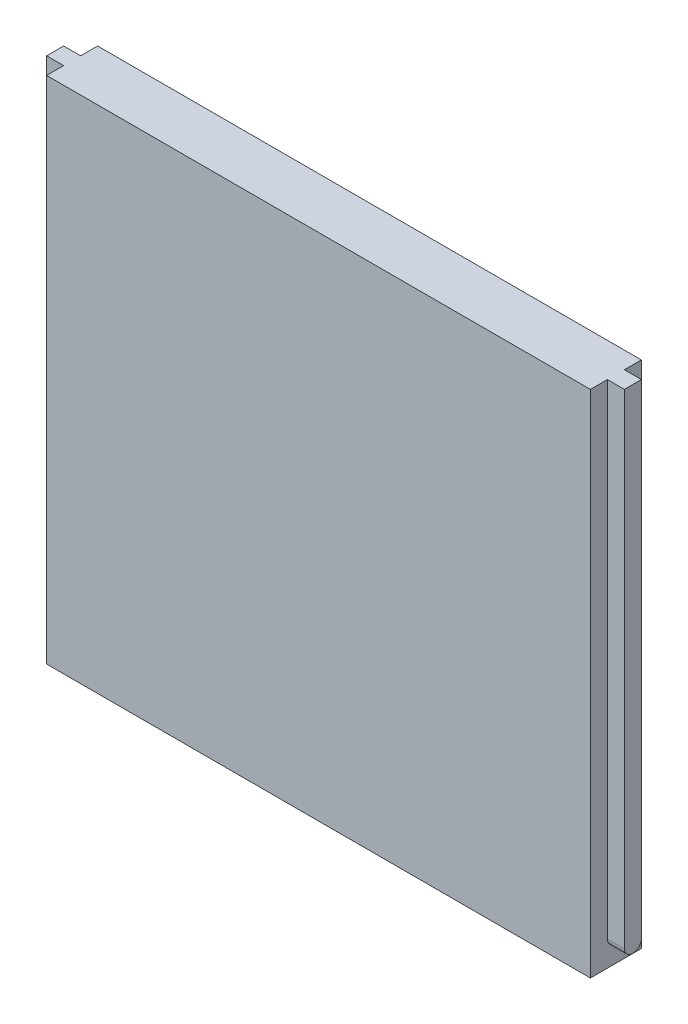
ISO-10303-21;
HEADER;
FILE_DESCRIPTION(('STEP AP214'),'2;1');
FILE_NAME('part.step','',(''),(''),'','','');
FILE_SCHEMA(('AUTOMOTIVE_DESIGN { 1 0 10303 214 1 1 1 1 }'));
ENDSEC;
DATA;
#1=APPLICATION_CONTEXT('core data for automotive mechanical design processes');
#2=APPLICATION_PROTOCOL_DEFINITION('international standard','automotive_design',2000,#1);
#3=PRODUCT_CONTEXT('',#1,'mechanical');
#4=PRODUCT('Part','Part','',(#3));
#5=PRODUCT_RELATED_PRODUCT_CATEGORY('part','',(#4));
#6=PRODUCT_DEFINITION_FORMATION('','',#4);
#7=PRODUCT_DEFINITION_CONTEXT('part definition',#1,'design');
#8=PRODUCT_DEFINITION('design','',#6,#7);
#9=PRODUCT_DEFINITION_SHAPE('','',#8);
#10=(LENGTH_UNIT() NAMED_UNIT(*) SI_UNIT(.MILLI.,.METRE.));
#11=(NAMED_UNIT(*) PLANE_ANGLE_UNIT() SI_UNIT($,.RADIAN.));
#12=(NAMED_UNIT(*) SI_UNIT($,.STERADIAN.) SOLID_ANGLE_UNIT());
#13=UNCERTAINTY_MEASURE_WITH_UNIT(LENGTH_MEASURE(1.E-05),#10,'distance_accuracy_value','');
#14=(GEOMETRIC_REPRESENTATION_CONTEXT(3) GLOBAL_UNCERTAINTY_ASSIGNED_CONTEXT((#13)) GLOBAL_UNIT_ASSIGNED_CONTEXT((#10,
#11,#12)) REPRESENTATION_CONTEXT('',''));
#15=CARTESIAN_POINT('',(0.,0.,0.));
#16=DIRECTION('',(0.,0.,1.));
#17=DIRECTION('',(1.,0.,0.));
#18=AXIS2_PLACEMENT_3D('',#15,#16,#17);
#19=CARTESIAN_POINT('',(85.,-58.7451361867704,5.));
#20=DIRECTION('',(0.,0.,1.));
#21=DIRECTION('',(0.,-1.,0.));
#22=AXIS2_PLACEMENT_3D('',#19,#20,#21);
#23=PLANE('',#22);
#24=DIRECTION('',(1.,0.,0.));
#25=VECTOR('',#24,1.);
#26=CARTESIAN_POINT('',(80.,83.7548638132294,5.));
#27=LINE('',#26,#25);
#28=CARTESIAN_POINT('',(80.,83.7548638132295,5.));
#29=VERTEX_POINT('',#28);
#30=CARTESIAN_POINT('',(85.,83.7548638132294,5.));
#31=VERTEX_POINT('',#30);
#32=EDGE_CURVE('E142',#29,#31,#27,.T.);
#33=ORIENTED_EDGE('',*,*,#32,.T.);
#34=DIRECTION('',(0.,1.,0.));
#35=VECTOR('',#34,1.);
#36=CARTESIAN_POINT('',(85.,-58.7451361867704,5.));
#37=LINE('',#36,#35);
#38=CARTESIAN_POINT('',(85.,-58.7451361867704,5.));
#39=VERTEX_POINT('',#38);
#40=EDGE_CURVE('E215',#39,#31,#37,.T.);
#41=ORIENTED_EDGE('',*,*,#40,.F.);
#42=DIRECTION('',(-1.,0.,0.));
#43=VECTOR('',#42,1.);
#44=CARTESIAN_POINT('',(85.,-58.7451361867704,5.));
#45=LINE('',#44,#43);
#46=CARTESIAN_POINT('',(80.,-58.7451361867704,5.));
#47=VERTEX_POINT('',#46);
#48=EDGE_CURVE('E187',#39,#47,#45,.T.);
#49=ORIENTED_EDGE('',*,*,#48,.T.);
#50=DIRECTION('',(0.,1.,0.));
#51=VECTOR('',#50,1.);
#52=CARTESIAN_POINT('',(80.,-58.7451361867704,5.));
#53=LINE('',#52,#51);
#54=EDGE_CURVE('E205',#47,#29,#53,.T.);
#55=ORIENTED_EDGE('',*,*,#54,.T.);
#56=EDGE_LOOP('',(#33,#41,#49,#55));
#57=FACE_BOUND('',#56,.T.);
#58=ADVANCED_FACE('F40',(#57),#23,.F.);
#59=CARTESIAN_POINT('',(85.,-58.7451361867704,10.));
#60=DIRECTION('',(0.,0.,-1.));
#61=DIRECTION('',(0.,1.,0.));
#62=AXIS2_PLACEMENT_3D('',#59,#60,#61);
#63=PLANE('',#62);
#64=DIRECTION('',(1.,0.,0.));
#65=VECTOR('',#64,1.);
#66=CARTESIAN_POINT('',(80.,83.7548638132294,10.));
#67=LINE('',#66,#65);
#68=CARTESIAN_POINT('',(80.,83.7548638132294,10.));
#69=VERTEX_POINT('',#68);
#70=CARTESIAN_POINT('',(85.,83.7548638132294,10.));
#71=VERTEX_POINT('',#70);
#72=EDGE_CURVE('E133',#69,#71,#67,.T.);
#73=ORIENTED_EDGE('',*,*,#72,.F.);
#74=DIRECTION('',(0.,-1.,0.));
#75=VECTOR('',#74,1.);
#76=CARTESIAN_POINT('',(80.,-58.7451361867704,10.));
#77=LINE('',#76,#75);
#78=CARTESIAN_POINT('',(80.,-58.7451361867704,10.));
#79=VERTEX_POINT('',#78);
#80=EDGE_CURVE('E50',#69,#79,#77,.T.);
#81=ORIENTED_EDGE('',*,*,#80,.T.);
#82=DIRECTION('',(-1.,0.,0.));
#83=VECTOR('',#82,1.);
#84=CARTESIAN_POINT('',(85.,-58.7451361867704,10.));
#85=LINE('',#84,#83);
#86=CARTESIAN_POINT('',(85.,-58.7451361867704,10.));
#87=VERTEX_POINT('',#86);
#88=EDGE_CURVE('E202',#87,#79,#85,.T.);
#89=ORIENTED_EDGE('',*,*,#88,.F.);
#90=DIRECTION('',(0.,-1.,0.));
#91=VECTOR('',#90,1.);
#92=CARTESIAN_POINT('',(85.,-58.7451361867704,10.));
#93=LINE('',#92,#91);
#94=EDGE_CURVE('E138',#71,#87,#93,.T.);
#95=ORIENTED_EDGE('',*,*,#94,.F.);
#96=EDGE_LOOP('',(#73,#81,#89,#95));
#97=FACE_BOUND('',#96,.T.);
#98=ADVANCED_FACE('F135',(#97),#63,.F.);
#99=CARTESIAN_POINT('',(85.,-58.7451361867704,7.5));
#100=DIRECTION('',(1.,0.,0.));
#101=DIRECTION('',(0.,1.,0.));
#102=AXIS2_PLACEMENT_3D('',#99,#100,#101);
#103=PLANE('',#102);
#104=ORIENTED_EDGE('',*,*,#40,.T.);
#105=DIRECTION('',(0.,0.,1.));
#106=VECTOR('',#105,1.);
#107=CARTESIAN_POINT('',(85.,83.7548638132294,5.));
#108=LINE('',#107,#106);
#109=EDGE_CURVE('E143',#31,#71,#108,.T.);
#110=ORIENTED_EDGE('',*,*,#109,.T.);
#111=ORIENTED_EDGE('',*,*,#94,.T.);
#112=CARTESIAN_POINT('',(85.,-58.7451361867704,7.5));
#113=DIRECTION('',(1.,0.,0.));
#114=DIRECTION('',(0.,1.,0.));
#115=AXIS2_PLACEMENT_3D('',#112,#113,#114);
#116=CIRCLE('',#115,2.5);
#117=EDGE_CURVE('E209',#87,#39,#116,.T.);
#118=ORIENTED_EDGE('',*,*,#117,.T.);
#119=EDGE_LOOP('',(#104,#110,#111,#118));
#120=FACE_BOUND('',#119,.T.);
#121=ADVANCED_FACE('F258',(#120),#103,.T.);
#122=CARTESIAN_POINT('',(80.,83.7548638132296,15.));
#123=DIRECTION('',(-1.,0.,0.));
#124=DIRECTION('',(0.,0.,1.));
#125=AXIS2_PLACEMENT_3D('',#122,#123,#124);
#126=PLANE('',#125);
#127=ORIENTED_EDGE('',*,*,#80,.F.);
#128=DIRECTION('',(0.,0.,-1.));
#129=VECTOR('',#128,1.);
#130=CARTESIAN_POINT('',(80.,83.7548638132296,15.));
#131=LINE('',#130,#129);
#132=CARTESIAN_POINT('',(80.,83.7548638132296,15.));
#133=VERTEX_POINT('',#132);
#134=EDGE_CURVE('E149',#133,#69,#131,.T.);
#135=ORIENTED_EDGE('',*,*,#134,.F.);
#136=DIRECTION('',(0.,1.,0.));
#137=VECTOR('',#136,1.);
#138=CARTESIAN_POINT('',(80.,83.7548638132296,15.));
#139=LINE('',#138,#137);
#140=CARTESIAN_POINT('',(80.,-66.2451361867704,15.));
#141=VERTEX_POINT('',#140);
#142=EDGE_CURVE('E190',#141,#133,#139,.T.);
#143=ORIENTED_EDGE('',*,*,#142,.F.);
#144=DIRECTION('',(0.,0.,-1.));
#145=VECTOR('',#144,1.);
#146=CARTESIAN_POINT('',(80.,-66.2451361867704,15.));
#147=LINE('',#146,#145);
#148=CARTESIAN_POINT('',(80.,-66.2451361867704,0.));
#149=VERTEX_POINT('',#148);
#150=EDGE_CURVE('E160',#141,#149,#147,.T.);
#151=ORIENTED_EDGE('',*,*,#150,.T.);
#152=DIRECTION('',(0.,1.,0.));
#153=VECTOR('',#152,1.);
#154=CARTESIAN_POINT('',(80.,83.7548638132296,0.));
#155=LINE('',#154,#153);
#156=CARTESIAN_POINT('',(80.,83.7548638132296,0.));
#157=VERTEX_POINT('',#156);
#158=EDGE_CURVE('E176',#149,#157,#155,.T.);
#159=ORIENTED_EDGE('',*,*,#158,.T.);
#160=EDGE_CURVE('E161',#29,#157,#131,.T.);
#161=ORIENTED_EDGE('',*,*,#160,.F.);
#162=ORIENTED_EDGE('',*,*,#54,.F.);
#163=CARTESIAN_POINT('',(80.,-58.7451361867704,7.5));
#164=DIRECTION('',(1.,0.,0.));
#165=DIRECTION('',(0.,1.,0.));
#166=AXIS2_PLACEMENT_3D('',#163,#164,#165);
#167=CIRCLE('',#166,2.5);
#168=EDGE_CURVE('E152',#79,#47,#167,.T.);
#169=ORIENTED_EDGE('',*,*,#168,.F.);
#170=EDGE_LOOP('',(#127,#135,#143,#151,#159,#161,#162,#169));
#171=FACE_BOUND('',#170,.T.);
#172=ADVANCED_FACE('F147',(#171),#126,.F.);
#173=CARTESIAN_POINT('',(-80.,-66.2451361867704,15.));
#174=DIRECTION('',(1.,0.,0.));
#175=DIRECTION('',(0.,0.,-1.));
#176=AXIS2_PLACEMENT_3D('',#173,#174,#175);
#177=PLANE('',#176);
#178=CARTESIAN_POINT('',(-80.,-58.7451361867704,7.5));
#179=DIRECTION('',(1.,0.,0.));
#180=DIRECTION('',(0.,1.,0.));
#181=AXIS2_PLACEMENT_3D('',#178,#179,#180);
#182=CIRCLE('',#181,2.5);
#183=CARTESIAN_POINT('',(-80.,-58.7451361867704,10.));
#184=VERTEX_POINT('',#183);
#185=CARTESIAN_POINT('',(-80.,-58.7451361867704,5.));
#186=VERTEX_POINT('',#185);
#187=EDGE_CURVE('E66',#184,#186,#182,.T.);
#188=ORIENTED_EDGE('',*,*,#187,.T.);
#189=DIRECTION('',(0.,1.,0.));
#190=VECTOR('',#189,1.);
#191=CARTESIAN_POINT('',(-80.,-58.7451361867704,5.));
#192=LINE('',#191,#190);
#193=CARTESIAN_POINT('',(-80.,83.7548638132294,5.));
#194=VERTEX_POINT('',#193);
#195=EDGE_CURVE('E228',#186,#194,#192,.T.);
#196=ORIENTED_EDGE('',*,*,#195,.T.);
#197=DIRECTION('',(0.,0.,-1.));
#198=VECTOR('',#197,1.);
#199=CARTESIAN_POINT('',(-80.,83.7548638132296,15.));
#200=LINE('',#199,#198);
#201=CARTESIAN_POINT('',(-80.,83.7548638132296,0.));
#202=VERTEX_POINT('',#201);
#203=EDGE_CURVE('E171',#194,#202,#200,.T.);
#204=ORIENTED_EDGE('',*,*,#203,.T.);
#205=DIRECTION('',(0.,-1.,0.));
#206=VECTOR('',#205,1.);
#207=CARTESIAN_POINT('',(-80.,-66.2451361867704,0.));
#208=LINE('',#207,#206);
#209=CARTESIAN_POINT('',(-80.,-66.2451361867704,0.));
#210=VERTEX_POINT('',#209);
#211=EDGE_CURVE('E183',#202,#210,#208,.T.);
#212=ORIENTED_EDGE('',*,*,#211,.T.);
#213=DIRECTION('',(0.,0.,-1.));
#214=VECTOR('',#213,1.);
#215=CARTESIAN_POINT('',(-80.,-66.2451361867704,15.));
#216=LINE('',#215,#214);
#217=CARTESIAN_POINT('',(-80.,-66.2451361867704,15.));
#218=VERTEX_POINT('',#217);
#219=EDGE_CURVE('E44',#218,#210,#216,.T.);
#220=ORIENTED_EDGE('',*,*,#219,.F.);
#221=DIRECTION('',(0.,-1.,0.));
#222=VECTOR('',#221,1.);
#223=CARTESIAN_POINT('',(-80.,-66.2451361867704,15.));
#224=LINE('',#223,#222);
#225=CARTESIAN_POINT('',(-80.,83.7548638132296,15.));
#226=VERTEX_POINT('',#225);
#227=EDGE_CURVE('E175',#226,#218,#224,.T.);
#228=ORIENTED_EDGE('',*,*,#227,.F.);
#229=CARTESIAN_POINT('',(-80.,83.7548638132294,10.));
#230=VERTEX_POINT('',#229);
#231=EDGE_CURVE('E166',#226,#230,#200,.T.);
#232=ORIENTED_EDGE('',*,*,#231,.T.);
#233=DIRECTION('',(0.,-1.,0.));
#234=VECTOR('',#233,1.);
#235=CARTESIAN_POINT('',(-80.,-58.7451361867704,10.));
#236=LINE('',#235,#234);
#237=EDGE_CURVE('E11',#230,#184,#236,.T.);
#238=ORIENTED_EDGE('',*,*,#237,.T.);
#239=EDGE_LOOP('',(#188,#196,#204,#212,#220,#228,#232,#238));
#240=FACE_BOUND('',#239,.T.);
#241=ADVANCED_FACE('F42',(#240),#177,.F.);
#242=CARTESIAN_POINT('',(80.,-66.2451361867704,15.));
#243=DIRECTION('',(0.,1.,0.));
#244=DIRECTION('',(-1.,0.,0.));
#245=AXIS2_PLACEMENT_3D('',#242,#243,#244);
#246=PLANE('',#245);
#247=DIRECTION('',(1.,0.,0.));
#248=VECTOR('',#247,1.);
#249=CARTESIAN_POINT('',(80.,-66.2451361867704,0.));
#250=LINE('',#249,#248);
#251=EDGE_CURVE('E180',#210,#149,#250,.T.);
#252=ORIENTED_EDGE('',*,*,#251,.T.);
#253=ORIENTED_EDGE('',*,*,#150,.F.);
#254=DIRECTION('',(1.,0.,0.));
#255=VECTOR('',#254,1.);
#256=CARTESIAN_POINT('',(80.,-66.2451361867704,15.));
#257=LINE('',#256,#255);
#258=EDGE_CURVE('E193',#218,#141,#257,.T.);
#259=ORIENTED_EDGE('',*,*,#258,.F.);
#260=ORIENTED_EDGE('',*,*,#219,.T.);
#261=EDGE_LOOP('',(#252,#253,#259,#260));
#262=FACE_BOUND('',#261,.T.);
#263=ADVANCED_FACE('F287',(#262),#246,.F.);
#264=CARTESIAN_POINT('',(-80.,83.7548638132296,15.));
#265=DIRECTION('',(0.,-1.,0.));
#266=DIRECTION('',(0.,0.,-1.));
#267=AXIS2_PLACEMENT_3D('',#264,#265,#266);
#268=PLANE('',#267);
#269=DIRECTION('',(-1.,0.,0.));
#270=VECTOR('',#269,1.);
#271=CARTESIAN_POINT('',(-80.,83.7548638132296,0.));
#272=LINE('',#271,#270);
#273=EDGE_CURVE('E172',#157,#202,#272,.T.);
#274=ORIENTED_EDGE('',*,*,#273,.T.);
#275=ORIENTED_EDGE('',*,*,#203,.F.);
#276=DIRECTION('',(-1.,0.,0.));
#277=VECTOR('',#276,1.);
#278=CARTESIAN_POINT('',(-80.,83.7548638132294,5.));
#279=LINE('',#278,#277);
#280=CARTESIAN_POINT('',(-85.,83.7548638132294,5.));
#281=VERTEX_POINT('',#280);
#282=EDGE_CURVE('E58',#194,#281,#279,.T.);
#283=ORIENTED_EDGE('',*,*,#282,.T.);
#284=DIRECTION('',(0.,0.,1.));
#285=VECTOR('',#284,1.);
#286=CARTESIAN_POINT('',(-85.,83.7548638132294,5.));
#287=LINE('',#286,#285);
#288=CARTESIAN_POINT('',(-85.,83.7548638132294,10.));
#289=VERTEX_POINT('',#288);
#290=EDGE_CURVE('E247',#281,#289,#287,.T.);
#291=ORIENTED_EDGE('',*,*,#290,.T.);
#292=DIRECTION('',(-1.,0.,0.));
#293=VECTOR('',#292,1.);
#294=CARTESIAN_POINT('',(-80.,83.7548638132294,10.));
#295=LINE('',#294,#293);
#296=EDGE_CURVE('E235',#230,#289,#295,.T.);
#297=ORIENTED_EDGE('',*,*,#296,.F.);
#298=ORIENTED_EDGE('',*,*,#231,.F.);
#299=DIRECTION('',(-1.,0.,0.));
#300=VECTOR('',#299,1.);
#301=CARTESIAN_POINT('',(-80.,83.7548638132296,15.));
#302=LINE('',#301,#300);
#303=EDGE_CURVE('E158',#133,#226,#302,.T.);
#304=ORIENTED_EDGE('',*,*,#303,.F.);
#305=ORIENTED_EDGE('',*,*,#134,.T.);
#306=ORIENTED_EDGE('',*,*,#72,.T.);
#307=ORIENTED_EDGE('',*,*,#109,.F.);
#308=ORIENTED_EDGE('',*,*,#32,.F.);
#309=ORIENTED_EDGE('',*,*,#160,.T.);
#310=EDGE_LOOP('',(#274,#275,#283,#291,#297,#298,#304,#305,#306,#307,#308,#309));
#311=FACE_BOUND('',#310,.T.);
#312=ADVANCED_FACE('F156',(#311),#268,.F.);
#313=CARTESIAN_POINT('',(0.,0.,15.));
#314=DIRECTION('',(0.,0.,-1.));
#315=DIRECTION('',(-1.,0.,0.));
#316=AXIS2_PLACEMENT_3D('',#313,#314,#315);
#317=PLANE('',#316);
#318=ORIENTED_EDGE('',*,*,#227,.T.);
#319=ORIENTED_EDGE('',*,*,#258,.T.);
#320=ORIENTED_EDGE('',*,*,#142,.T.);
#321=ORIENTED_EDGE('',*,*,#303,.T.);
#322=EDGE_LOOP('',(#318,#319,#320,#321));
#323=FACE_BOUND('',#322,.T.);
#324=ADVANCED_FACE('F284',(#323),#317,.F.);
#325=CARTESIAN_POINT('',(0.,0.,0.));
#326=DIRECTION('',(0.,0.,-1.));
#327=DIRECTION('',(-1.,0.,0.));
#328=AXIS2_PLACEMENT_3D('',#325,#326,#327);
#329=PLANE('',#328);
#330=ORIENTED_EDGE('',*,*,#211,.F.);
#331=ORIENTED_EDGE('',*,*,#273,.F.);
#332=ORIENTED_EDGE('',*,*,#158,.F.);
#333=ORIENTED_EDGE('',*,*,#251,.F.);
#334=EDGE_LOOP('',(#330,#331,#332,#333));
#335=FACE_BOUND('',#334,.T.);
#336=ADVANCED_FACE('F266',(#335),#329,.T.);
#337=CARTESIAN_POINT('',(85.,-58.7451361867704,7.5));
#338=DIRECTION('',(-1.,0.,0.));
#339=DIRECTION('',(0.,-1.,0.));
#340=AXIS2_PLACEMENT_3D('',#337,#338,#339);
#341=CYLINDRICAL_SURFACE('',#340,2.5);
#342=ORIENTED_EDGE('',*,*,#168,.T.);
#343=ORIENTED_EDGE('',*,*,#48,.F.);
#344=ORIENTED_EDGE('',*,*,#117,.F.);
#345=ORIENTED_EDGE('',*,*,#88,.T.);
#346=EDGE_LOOP('',(#342,#343,#344,#345));
#347=FACE_BOUND('',#346,.T.);
#348=ADVANCED_FACE('F304',(#347),#341,.T.);
#349=CARTESIAN_POINT('',(-85.,-58.7451361867704,7.5));
#350=DIRECTION('',(1.,0.,0.));
#351=DIRECTION('',(0.,1.,0.));
#352=AXIS2_PLACEMENT_3D('',#349,#350,#351);
#353=CYLINDRICAL_SURFACE('',#352,2.5);
#354=ORIENTED_EDGE('',*,*,#187,.F.);
#355=DIRECTION('',(1.,0.,0.));
#356=VECTOR('',#355,1.);
#357=CARTESIAN_POINT('',(-85.,-58.7451361867704,10.));
#358=LINE('',#357,#356);
#359=CARTESIAN_POINT('',(-85.,-58.7451361867704,10.));
#360=VERTEX_POINT('',#359);
#361=EDGE_CURVE('E212',#360,#184,#358,.T.);
#362=ORIENTED_EDGE('',*,*,#361,.F.);
#363=CARTESIAN_POINT('',(-85.,-58.7451361867704,7.5));
#364=DIRECTION('',(1.,0.,0.));
#365=DIRECTION('',(0.,1.,0.));
#366=AXIS2_PLACEMENT_3D('',#363,#364,#365);
#367=CIRCLE('',#366,2.5);
#368=CARTESIAN_POINT('',(-85.,-58.7451361867704,5.));
#369=VERTEX_POINT('',#368);
#370=EDGE_CURVE('E231',#360,#369,#367,.T.);
#371=ORIENTED_EDGE('',*,*,#370,.T.);
#372=DIRECTION('',(1.,0.,0.));
#373=VECTOR('',#372,1.);
#374=CARTESIAN_POINT('',(-85.,-58.7451361867704,5.));
#375=LINE('',#374,#373);
#376=EDGE_CURVE('E224',#369,#186,#375,.T.);
#377=ORIENTED_EDGE('',*,*,#376,.T.);
#378=EDGE_LOOP('',(#354,#362,#371,#377));
#379=FACE_BOUND('',#378,.T.);
#380=ADVANCED_FACE('F307',(#379),#353,.T.);
#381=CARTESIAN_POINT('',(-85.,-58.7451361867704,10.));
#382=DIRECTION('',(0.,0.,1.));
#383=DIRECTION('',(0.,-1.,0.));
#384=AXIS2_PLACEMENT_3D('',#381,#382,#383);
#385=PLANE('',#384);
#386=ORIENTED_EDGE('',*,*,#296,.T.);
#387=DIRECTION('',(0.,-1.,0.));
#388=VECTOR('',#387,1.);
#389=CARTESIAN_POINT('',(-85.,-58.7451361867704,10.));
#390=LINE('',#389,#388);
#391=EDGE_CURVE('E239',#289,#360,#390,.T.);
#392=ORIENTED_EDGE('',*,*,#391,.T.);
#393=ORIENTED_EDGE('',*,*,#361,.T.);
#394=ORIENTED_EDGE('',*,*,#237,.F.);
#395=EDGE_LOOP('',(#386,#392,#393,#394));
#396=FACE_BOUND('',#395,.T.);
#397=ADVANCED_FACE('F282',(#396),#385,.T.);
#398=CARTESIAN_POINT('',(-85.,-58.7451361867704,5.));
#399=DIRECTION('',(0.,0.,-1.));
#400=DIRECTION('',(0.,1.,0.));
#401=AXIS2_PLACEMENT_3D('',#398,#399,#400);
#402=PLANE('',#401);
#403=ORIENTED_EDGE('',*,*,#282,.F.);
#404=ORIENTED_EDGE('',*,*,#195,.F.);
#405=ORIENTED_EDGE('',*,*,#376,.F.);
#406=DIRECTION('',(0.,1.,0.));
#407=VECTOR('',#406,1.);
#408=CARTESIAN_POINT('',(-85.,-58.7451361867704,5.));
#409=LINE('',#408,#407);
#410=EDGE_CURVE('E227',#369,#281,#409,.T.);
#411=ORIENTED_EDGE('',*,*,#410,.T.);
#412=EDGE_LOOP('',(#403,#404,#405,#411));
#413=FACE_BOUND('',#412,.T.);
#414=ADVANCED_FACE('F274',(#413),#402,.T.);
#415=CARTESIAN_POINT('',(-85.,-58.7451361867704,7.5));
#416=DIRECTION('',(-1.,0.,0.));
#417=DIRECTION('',(0.,1.,0.));
#418=AXIS2_PLACEMENT_3D('',#415,#416,#417);
#419=PLANE('',#418);
#420=ORIENTED_EDGE('',*,*,#290,.F.);
#421=ORIENTED_EDGE('',*,*,#410,.F.);
#422=ORIENTED_EDGE('',*,*,#370,.F.);
#423=ORIENTED_EDGE('',*,*,#391,.F.);
#424=EDGE_LOOP('',(#420,#421,#422,#423));
#425=FACE_BOUND('',#424,.T.);
#426=ADVANCED_FACE('F278',(#425),#419,.T.);
#427=CLOSED_SHELL('',(#58,#98,#121,#172,#241,#263,#312,#324,#336,#348,#380,#397,#414,#426));
#428=MANIFOLD_SOLID_BREP('B2',#427);
#429=ADVANCED_BREP_SHAPE_REPRESENTATION('',(#18,#428),#14);
#430=SHAPE_DEFINITION_REPRESENTATION(#9,#429);
ENDSEC;
END-ISO-10303-21;
